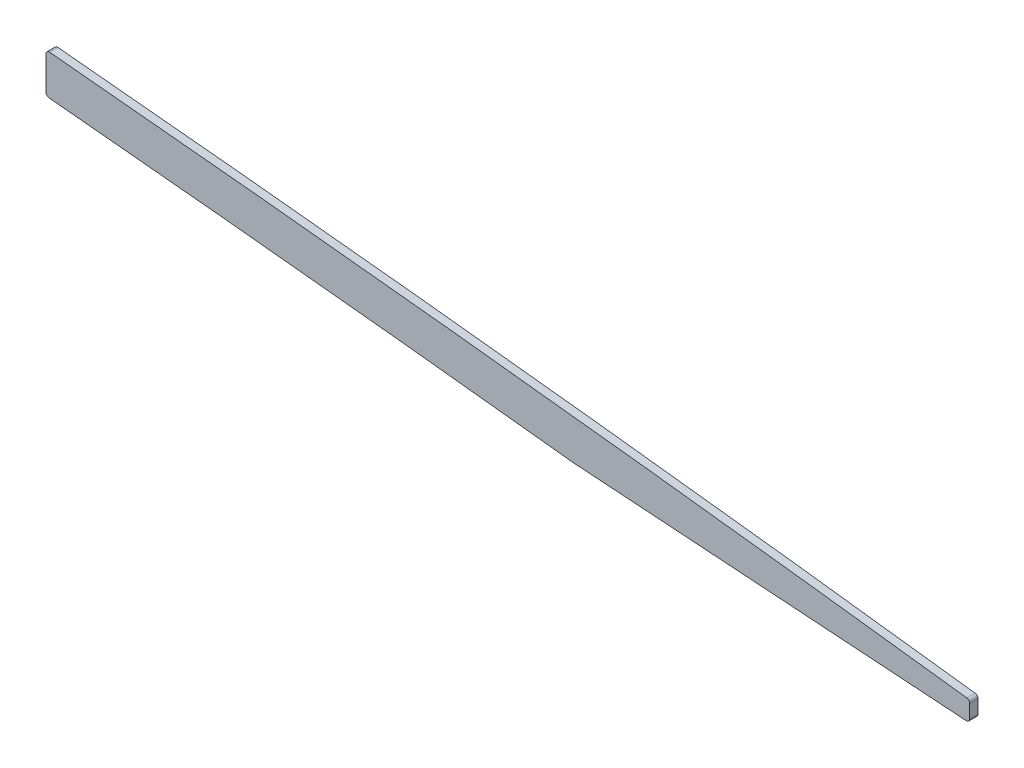
ISO-10303-21;
HEADER;
FILE_DESCRIPTION(('STEP AP214'),'2;1');
FILE_NAME('part.step','',(''),(''),'','','');
FILE_SCHEMA(('AUTOMOTIVE_DESIGN { 1 0 10303 214 1 1 1 1 }'));
ENDSEC;
DATA;
#1=APPLICATION_CONTEXT('core data for automotive mechanical design processes');
#2=APPLICATION_PROTOCOL_DEFINITION('international standard','automotive_design',2000,#1);
#3=PRODUCT_CONTEXT('',#1,'mechanical');
#4=PRODUCT('Part','Part','',(#3));
#5=PRODUCT_RELATED_PRODUCT_CATEGORY('part','',(#4));
#6=PRODUCT_DEFINITION_FORMATION('','',#4);
#7=PRODUCT_DEFINITION_CONTEXT('part definition',#1,'design');
#8=PRODUCT_DEFINITION('design','',#6,#7);
#9=PRODUCT_DEFINITION_SHAPE('','',#8);
#10=(LENGTH_UNIT() NAMED_UNIT(*) SI_UNIT(.MILLI.,.METRE.));
#11=(NAMED_UNIT(*) PLANE_ANGLE_UNIT() SI_UNIT($,.RADIAN.));
#12=(NAMED_UNIT(*) SI_UNIT($,.STERADIAN.) SOLID_ANGLE_UNIT());
#13=UNCERTAINTY_MEASURE_WITH_UNIT(LENGTH_MEASURE(1.E-05),#10,'distance_accuracy_value','');
#14=(GEOMETRIC_REPRESENTATION_CONTEXT(3) GLOBAL_UNCERTAINTY_ASSIGNED_CONTEXT((#13)) GLOBAL_UNIT_ASSIGNED_CONTEXT((#10,
#11,#12)) REPRESENTATION_CONTEXT('',''));
#15=CARTESIAN_POINT('',(0.,0.,0.));
#16=DIRECTION('',(0.,0.,1.));
#17=DIRECTION('',(1.,0.,0.));
#18=AXIS2_PLACEMENT_3D('',#15,#16,#17);
#19=CARTESIAN_POINT('',(2311.4,-7.40544774906732E-11,1.5875));
#20=DIRECTION('',(1.,0.,0.));
#21=DIRECTION('',(0.,1.,0.));
#22=AXIS2_PLACEMENT_3D('',#19,#20,#21);
#23=PLANE('',#22);
#24=DIRECTION('',(0.,-1.,0.));
#25=VECTOR('',#24,1.);
#26=CARTESIAN_POINT('',(2311.4,-7.40544774906732E-11,-1.5875));
#27=LINE('',#26,#25);
#28=CARTESIAN_POINT('',(2311.4,134.435488249285,-1.5875));
#29=VERTEX_POINT('',#28);
#30=CARTESIAN_POINT('',(2311.4,121.679854212148,-1.5875));
#31=VERTEX_POINT('',#30);
#32=EDGE_CURVE('E270',#29,#31,#27,.T.);
#33=ORIENTED_EDGE('',*,*,#32,.T.);
#34=DIRECTION('',(0.,0.,-1.));
#35=VECTOR('',#34,1.);
#36=CARTESIAN_POINT('',(2311.4,121.679854212148,1.5875));
#37=LINE('',#36,#35);
#38=CARTESIAN_POINT('',(2311.4,121.679854212148,1.5875));
#39=VERTEX_POINT('',#38);
#40=EDGE_CURVE('E226',#31,#39,#37,.F.);
#41=ORIENTED_EDGE('',*,*,#40,.T.);
#42=DIRECTION('',(0.,-1.,0.));
#43=VECTOR('',#42,1.);
#44=CARTESIAN_POINT('',(2311.4,-7.40544774906732E-11,1.5875));
#45=LINE('',#44,#43);
#46=CARTESIAN_POINT('',(2311.4,134.435488249285,1.5875));
#47=VERTEX_POINT('',#46);
#48=EDGE_CURVE('E147',#47,#39,#45,.T.);
#49=ORIENTED_EDGE('',*,*,#48,.F.);
#50=DIRECTION('',(0.,0.,1.));
#51=VECTOR('',#50,1.);
#52=CARTESIAN_POINT('',(2311.4,134.435488249285,-1.5875));
#53=LINE('',#52,#51);
#54=EDGE_CURVE('E299',#47,#29,#53,.F.);
#55=ORIENTED_EDGE('',*,*,#54,.T.);
#56=EDGE_LOOP('',(#33,#41,#49,#55));
#57=FACE_BOUND('',#56,.T.);
#58=ADVANCED_FACE('F47',(#57),#23,.F.);
#59=CARTESIAN_POINT('',(816.035490090418,249.602504502473,1.5875));
#60=CARTESIAN_POINT('',(820.895958915978,248.948752998504,1.5875));
#61=CARTESIAN_POINT('',(830.611237516535,247.699685180795,1.5875));
#62=CARTESIAN_POINT('',(845.281067269815,245.953419482549,1.5875));
#63=CARTESIAN_POINT('',(860.086531547021,244.295598067093,1.5875));
#64=CARTESIAN_POINT('',(879.83070343434,242.186646027517,1.5875));
#65=CARTESIAN_POINT('',(904.36996709185,239.698279805688,1.5875));
#66=CARTESIAN_POINT('',(933.571022669327,236.832150625483,1.5875));
#67=CARTESIAN_POINT('',(962.642718040815,234.023667740898,1.5875));
#68=CARTESIAN_POINT('',(991.762593942943,231.241975908087,1.5875));
#69=CARTESIAN_POINT('',(1021.07201031471,228.475862291185,1.5875));
#70=CARTESIAN_POINT('',(1060.37643731472,224.796956681051,1.5875));
#71=CARTESIAN_POINT('',(1109.51301557685,220.18437886172,1.5875));
#72=CARTESIAN_POINT('',(1168.51119036116,214.817071985159,1.5875));
#73=CARTESIAN_POINT('',(1227.50012979269,209.662054041939,1.5875));
#74=CARTESIAN_POINT('',(1306.13316794657,203.021178328389,1.5875));
#75=CARTESIAN_POINT('',(1404.36147710547,194.920725932278,1.5875));
#76=CARTESIAN_POINT('',(1522.23985107062,184.918066624094,1.5875));
#77=CARTESIAN_POINT('',(1640.18285649102,175.16700778633,1.5875));
#78=CARTESIAN_POINT('',(1758.16535256682,165.7576394845,1.5875));
#79=CARTESIAN_POINT('',(1876.15538476943,156.590937078959,1.5875));
#80=CARTESIAN_POINT('',(1994.08749188002,147.453250142139,1.5875));
#81=CARTESIAN_POINT('',(2092.26869206097,139.624216053351,1.5875));
#82=CARTESIAN_POINT('',(2170.74802904205,133.07965672904,1.5875));
#83=CARTESIAN_POINT('',(2219.77173097685,128.842227835716,1.5875));
#84=CARTESIAN_POINT('',(2258.98398824696,125.347211495477,1.5875));
#85=CARTESIAN_POINT('',(2288.37945753647,122.670854497073,1.5875));
#86=CARTESIAN_POINT('',(2317.81224311603,119.931729386451,1.5875));
#87=CARTESIAN_POINT('',(2347.55150917161,117.100365282643,1.5875));
#88=CARTESIAN_POINT('',(2377.15989972739,114.210118529692,1.5875));
#89=CARTESIAN_POINT('',(2406.46965385077,111.268968010355,1.5875));
#90=CARTESIAN_POINT('',(2435.81832605954,108.240091266207,1.5875));
#91=CARTESIAN_POINT('',(2469.02470752222,104.715289084564,1.5875));
#92=CARTESIAN_POINT('',(2497.31327256554,101.612328458115,1.5875));
#93=CARTESIAN_POINT('',(2518.24528997175,99.2591125176473,1.5875));
#94=CARTESIAN_POINT('',(2543.59485523623,96.3823723988054,1.5875));
#95=CARTESIAN_POINT('',(2583.46809293913,91.7389200548886,1.5875));
#96=CARTESIAN_POINT('',(2626.50474404992,86.507235465956,1.5875));
#97=CARTESIAN_POINT('',(2656.9573225255,82.7046844863666,1.5875));
#98=CARTESIAN_POINT('',(2676.22814845177,80.2695409508187,1.5875));
#99=CARTESIAN_POINT('',(2689.72957405404,78.5388507758172,1.5875));
#100=CARTESIAN_POINT('',(2697.83785996013,77.4903351724698,1.5875));
#101=B_SPLINE_CURVE_WITH_KNOTS('',3,(#59,#60,#61,#62,#63,#64,#65,#66,#67,#68,#69,#70,#71,#72,
#73,#74,#75,#76,#77,#78,#79,#80,#81,#82,#83,#84,#85,#86,#87,#88,#89,#90,#91,#92,#93,#94,#95,#96,
#97,#98,#99,#100),.UNSPECIFIED.,.F.,.F.,(4,1,1,1,1,1,1,1,1,1,1,1,1,1,1,1,1,1,1,1,1,1,1,1,1,1,1,
1,1,1,1,1,1,1,1,1,1,1,1,4),(77.9308215150932,79.3861761032565,80.8415306914199,82.2968852795832,
83.7522398677466,86.6629490440732,89.5736582203999,92.4843673967266,95.3950765730532,
98.3057857493799,101.216494925707,107.03791327836,112.859331631013,118.680749983667,
124.50216833632,136.145005041627,147.787841746933,159.43067845224,171.073515157547,
182.716351862853,194.35918856816,206.002025273467,211.82344362612,217.644861978773,
220.5555711551,223.466280331427,226.376989507753,229.28769868408,232.198407860407,
235.109117036733,238.01982621306,240.930535389387,244.99811874271,246.453473330873,
247.181150624955,252.573372094693,258.394790447347,260.132380463724,261.765911798234,
264.2162088),.UNSPECIFIED.);
#102=DIRECTION('',(0.,0.,-1.));
#103=VECTOR('',#102,1.);
#104=SURFACE_OF_LINEAR_EXTRUSION('',#101,#103);
#105=CARTESIAN_POINT('',(2312.55144834193,120.415399584901,1.5875));
#106=VERTEX_POINT('',#105);
#107=CARTESIAN_POINT('',(2513.37105245866,99.8062133455946,1.5875));
#108=VERTEX_POINT('',#107);
#109=EDGE_CURVE('E130',#106,#108,#101,.T.);
#110=ORIENTED_EDGE('',*,*,#109,.F.);
#111=DIRECTION('',(0.,0.,-1.));
#112=VECTOR('',#111,1.);
#113=CARTESIAN_POINT('',(2312.55144834193,120.415399584901,1.5875));
#114=LINE('',#113,#112);
#115=CARTESIAN_POINT('',(2312.55144834193,120.415399584901,-1.5875));
#116=VERTEX_POINT('',#115);
#117=EDGE_CURVE('E139',#106,#116,#114,.T.);
#118=ORIENTED_EDGE('',*,*,#117,.T.);
#119=CARTESIAN_POINT('',(816.035490090418,249.602504502473,-1.5875));
#120=CARTESIAN_POINT('',(820.895958915978,248.948752998504,-1.5875));
#121=CARTESIAN_POINT('',(830.611237516535,247.699685180795,-1.5875));
#122=CARTESIAN_POINT('',(845.281067269815,245.953419482549,-1.5875));
#123=CARTESIAN_POINT('',(860.086531547021,244.295598067093,-1.5875));
#124=CARTESIAN_POINT('',(879.83070343434,242.186646027517,-1.5875));
#125=CARTESIAN_POINT('',(904.36996709185,239.698279805688,-1.5875));
#126=CARTESIAN_POINT('',(933.571022669327,236.832150625483,-1.5875));
#127=CARTESIAN_POINT('',(962.642718040815,234.023667740898,-1.5875));
#128=CARTESIAN_POINT('',(991.762593942943,231.241975908087,-1.5875));
#129=CARTESIAN_POINT('',(1021.07201031471,228.475862291185,-1.5875));
#130=CARTESIAN_POINT('',(1060.37643731472,224.796956681051,-1.5875));
#131=CARTESIAN_POINT('',(1109.51301557685,220.18437886172,-1.5875));
#132=CARTESIAN_POINT('',(1168.51119036116,214.817071985159,-1.5875));
#133=CARTESIAN_POINT('',(1227.50012979269,209.662054041939,-1.5875));
#134=CARTESIAN_POINT('',(1306.13316794657,203.021178328389,-1.5875));
#135=CARTESIAN_POINT('',(1404.36147710547,194.920725932278,-1.5875));
#136=CARTESIAN_POINT('',(1522.23985107062,184.918066624094,-1.5875));
#137=CARTESIAN_POINT('',(1640.18285649102,175.16700778633,-1.5875));
#138=CARTESIAN_POINT('',(1758.16535256682,165.7576394845,-1.5875));
#139=CARTESIAN_POINT('',(1876.15538476943,156.590937078959,-1.5875));
#140=CARTESIAN_POINT('',(1994.08749188002,147.453250142139,-1.5875));
#141=CARTESIAN_POINT('',(2092.26869206097,139.624216053351,-1.5875));
#142=CARTESIAN_POINT('',(2170.74802904205,133.07965672904,-1.5875));
#143=CARTESIAN_POINT('',(2219.77173097685,128.842227835716,-1.5875));
#144=CARTESIAN_POINT('',(2258.98398824696,125.347211495477,-1.5875));
#145=CARTESIAN_POINT('',(2288.37945753647,122.670854497073,-1.5875));
#146=CARTESIAN_POINT('',(2317.81224311603,119.931729386451,-1.5875));
#147=CARTESIAN_POINT('',(2347.55150917161,117.100365282643,-1.5875));
#148=CARTESIAN_POINT('',(2377.15989972739,114.210118529692,-1.5875));
#149=CARTESIAN_POINT('',(2406.46965385077,111.268968010355,-1.5875));
#150=CARTESIAN_POINT('',(2435.81832605954,108.240091266207,-1.5875));
#151=CARTESIAN_POINT('',(2469.02470752222,104.715289084564,-1.5875));
#152=CARTESIAN_POINT('',(2497.31327256554,101.612328458115,-1.5875));
#153=CARTESIAN_POINT('',(2518.24528997175,99.2591125176473,-1.5875));
#154=CARTESIAN_POINT('',(2543.59485523623,96.3823723988054,-1.5875));
#155=CARTESIAN_POINT('',(2583.46809293913,91.7389200548886,-1.5875));
#156=CARTESIAN_POINT('',(2626.50474404992,86.507235465956,-1.5875));
#157=CARTESIAN_POINT('',(2656.9573225255,82.7046844863666,-1.5875));
#158=CARTESIAN_POINT('',(2676.22814845177,80.2695409508187,-1.5875));
#159=CARTESIAN_POINT('',(2689.72957405404,78.5388507758172,-1.5875));
#160=CARTESIAN_POINT('',(2697.83785996013,77.4903351724698,-1.5875));
#161=B_SPLINE_CURVE_WITH_KNOTS('',3,(#119,#120,#121,#122,#123,#124,#125,#126,#127,#128,#129,
#130,#131,#132,#133,#134,#135,#136,#137,#138,#139,#140,#141,#142,#143,#144,#145,#146,#147,#148,
#149,#150,#151,#152,#153,#154,#155,#156,#157,#158,#159,#160),.UNSPECIFIED.,.F.,.F.,(4,1,1,1,1,1,
1,1,1,1,1,1,1,1,1,1,1,1,1,1,1,1,1,1,1,1,1,1,1,1,1,1,1,1,1,1,1,1,1,4),(77.9308215150932,
79.3861761032565,80.8415306914199,82.2968852795832,83.7522398677466,86.6629490440732,
89.5736582203999,92.4843673967266,95.3950765730532,98.3057857493799,101.216494925707,
107.03791327836,112.859331631013,118.680749983667,124.50216833632,136.145005041627,
147.787841746933,159.43067845224,171.073515157547,182.716351862853,194.35918856816,
206.002025273467,211.82344362612,217.644861978773,220.5555711551,223.466280331427,
226.376989507753,229.28769868408,232.198407860407,235.109117036733,238.01982621306,
240.930535389387,244.99811874271,246.453473330873,247.181150624955,252.573372094693,
258.394790447347,260.132380463724,261.765911798234,264.2162088),.UNSPECIFIED.);
#162=CARTESIAN_POINT('',(2513.37105245866,99.8062133455946,-1.5875));
#163=VERTEX_POINT('',#162);
#164=EDGE_CURVE('E137',#116,#163,#161,.T.);
#165=ORIENTED_EDGE('',*,*,#164,.T.);
#166=DIRECTION('',(0.,0.,-1.));
#167=VECTOR('',#166,1.);
#168=CARTESIAN_POINT('',(2513.37105245866,99.8062133455946,1.5875));
#169=LINE('',#168,#167);
#170=EDGE_CURVE('E124',#108,#163,#169,.T.);
#171=ORIENTED_EDGE('',*,*,#170,.F.);
#172=EDGE_LOOP('',(#110,#118,#165,#171));
#173=FACE_BOUND('',#172,.T.);
#174=ADVANCED_FACE('F134',(#173),#104,.F.);
#175=CARTESIAN_POINT('',(18.6387186444081,271.237546195136,1.5875));
#176=DIRECTION('',(-0.0685556534196936,-0.997647293578346,0.));
#177=DIRECTION('',(0.997647293578346,-0.0685556534196936,0.));
#178=AXIS2_PLACEMENT_3D('',#175,#176,#177);
#179=PLANE('',#178);
#180=DIRECTION('',(-0.997647293578346,0.0685556534196936,0.));
#181=VECTOR('',#180,1.);
#182=CARTESIAN_POINT('',(18.6387186444081,271.237546195136,-1.5875));
#183=LINE('',#182,#181);
#184=CARTESIAN_POINT('',(2664.05543432016,89.451585687953,-1.5875));
#185=VERTEX_POINT('',#184);
#186=EDGE_CURVE('E277',#185,#163,#183,.T.);
#187=ORIENTED_EDGE('',*,*,#186,.F.);
#188=DIRECTION('',(0.,0.,-1.));
#189=VECTOR('',#188,1.);
#190=CARTESIAN_POINT('',(2664.05543432016,89.4515856879531,1.5875));
#191=LINE('',#190,#189);
#192=CARTESIAN_POINT('',(2664.05543432016,89.451585687953,1.5875));
#193=VERTEX_POINT('',#192);
#194=EDGE_CURVE('E11',#185,#193,#191,.F.);
#195=ORIENTED_EDGE('',*,*,#194,.T.);
#196=DIRECTION('',(-0.997647293578346,0.0685556534196936,0.));
#197=VECTOR('',#196,1.);
#198=CARTESIAN_POINT('',(18.6387186444081,271.237546195136,1.5875));
#199=LINE('',#198,#197);
#200=EDGE_CURVE('E120',#193,#108,#199,.T.);
#201=ORIENTED_EDGE('',*,*,#200,.T.);
#202=ORIENTED_EDGE('',*,*,#170,.T.);
#203=EDGE_LOOP('',(#187,#195,#201,#202));
#204=FACE_BOUND('',#203,.T.);
#205=ADVANCED_FACE('F123',(#204),#179,.T.);
#206=CARTESIAN_POINT('',(2665.41250000001,1.54114769880156E-10,1.5875));
#207=DIRECTION('',(1.,0.,0.));
#208=DIRECTION('',(0.,1.,0.));
#209=AXIS2_PLACEMENT_3D('',#206,#207,#208);
#210=PLANE('',#209);
#211=DIRECTION('',(0.,-1.,0.));
#212=VECTOR('',#211,1.);
#213=CARTESIAN_POINT('',(2665.41250000001,1.54114769880156E-10,-1.5875));
#214=LINE('',#213,#212);
#215=CARTESIAN_POINT('',(2665.4125,95.8764407852826,-1.5875));
#216=VERTEX_POINT('',#215);
#217=CARTESIAN_POINT('',(2665.4125,90.7185977507976,-1.5875));
#218=VERTEX_POINT('',#217);
#219=EDGE_CURVE('E199',#216,#218,#214,.T.);
#220=ORIENTED_EDGE('',*,*,#219,.F.);
#221=DIRECTION('',(0.,0.,-1.));
#222=VECTOR('',#221,1.);
#223=CARTESIAN_POINT('',(2665.4125,95.8764407852826,1.5875));
#224=LINE('',#223,#222);
#225=CARTESIAN_POINT('',(2665.4125,95.8764407852826,1.5875));
#226=VERTEX_POINT('',#225);
#227=EDGE_CURVE('E56',#216,#226,#224,.F.);
#228=ORIENTED_EDGE('',*,*,#227,.T.);
#229=DIRECTION('',(0.,-1.,0.));
#230=VECTOR('',#229,1.);
#231=CARTESIAN_POINT('',(2665.41250000001,1.54114769880156E-10,1.5875));
#232=LINE('',#231,#230);
#233=CARTESIAN_POINT('',(2665.4125,90.7185977507976,1.5875));
#234=VERTEX_POINT('',#233);
#235=EDGE_CURVE('E129',#226,#234,#232,.T.);
#236=ORIENTED_EDGE('',*,*,#235,.T.);
#237=DIRECTION('',(0.,0.,-1.));
#238=VECTOR('',#237,1.);
#239=CARTESIAN_POINT('',(2665.4125,90.7185977507976,1.5875));
#240=LINE('',#239,#238);
#241=EDGE_CURVE('E201',#234,#218,#240,.T.);
#242=ORIENTED_EDGE('',*,*,#241,.T.);
#243=EDGE_LOOP('',(#220,#228,#236,#242));
#244=FACE_BOUND('',#243,.T.);
#245=ADVANCED_FACE('F197',(#244),#210,.T.);
#246=CARTESIAN_POINT('',(818.067033698442,264.706491743222,1.5875));
#247=CARTESIAN_POINT('',(827.043059883077,263.499182154688,1.5875));
#248=CARTESIAN_POINT('',(836.029088262746,262.37336018535,1.5875));
#249=CARTESIAN_POINT('',(845.086758911477,261.305822737124,1.5875));
#250=CARTESIAN_POINT('',(891.386485356828,256.087047064925,1.5875));
#251=CARTESIAN_POINT('',(937.686211733138,251.779150949417,1.5875));
#252=CARTESIAN_POINT('',(973.452075064018,248.227669424888,1.5875));
#253=CARTESIAN_POINT('',(1071.94667214103,239.051054037575,1.5875));
#254=CARTESIAN_POINT('',(1170.4412693194,229.731506737662,1.5875));
#255=CARTESIAN_POINT('',(1231.79194034372,224.503945812963,1.5875));
#256=CARTESIAN_POINT('',(1324.89933614602,216.790627817024,1.5875));
#257=CARTESIAN_POINT('',(1418.00673093479,209.040117977579,1.5875));
#258=CARTESIAN_POINT('',(1449.7429359212,206.361809936344,1.5875));
#259=CARTESIAN_POINT('',(1636.92860677809,190.521130341518,1.5875));
#260=CARTESIAN_POINT('',(1824.11427763497,175.409157235081,1.5875));
#261=CARTESIAN_POINT('',(1979.96694737597,164.299650252625,1.5875));
#262=CARTESIAN_POINT('',(2156.26863942885,150.414433314205,1.5875));
#263=CARTESIAN_POINT('',(2332.5703304682,133.85721640186,1.5875));
#264=CARTESIAN_POINT('',(2354.21298315715,131.785082220072,1.5875));
#265=CARTESIAN_POINT('',(2436.3555443117,123.723952135345,1.5875));
#266=CARTESIAN_POINT('',(2518.49810546626,114.859112916573,1.5875));
#267=CARTESIAN_POINT('',(2579.48130742255,107.74251493933,1.5875));
#268=CARTESIAN_POINT('',(2639.63682069028,100.383443901382,1.5875));
#269=CARTESIAN_POINT('',(2699.79233294449,92.6044886503654,1.5875));
#270=(BOUNDED_CURVE() B_SPLINE_CURVE(5,(#246,#247,#248,#249,#250,#251,#252,#253,#254,#255,#256,
#257,#258,#259,#260,#261,#262,#263,#264,#265,#266,#267,#268,#269),.UNSPECIFIED.,.F.,
.F.) B_SPLINE_CURVE_WITH_KNOTS((6,3,3,3,3,3,3,6),(77.9308215150932,82.46579272,100.7932901,
131.0989539,146.7691983,223.5339586,233.9431167,264.2162088),
.UNSPECIFIED.) CURVE() GEOMETRIC_REPRESENTATION_ITEM() RATIONAL_B_SPLINE_CURVE((1.,1.,1.,1.,1.,
1.,1.,1.,1.,1.,1.,1.,1.,1.,1.,1.,1.,1.,1.,1.,1.,1.,1.,1.)) REPRESENTATION_ITEM(''));
#271=DIRECTION('',(0.,0.,-1.));
#272=VECTOR('',#271,1.);
#273=SURFACE_OF_LINEAR_EXTRUSION('',#270,#272);
#274=CARTESIAN_POINT('',(2664.30138258873,97.1364631354804,-1.5875));
#275=CARTESIAN_POINT('',(2611.18909164487,103.833660432831,-1.5875));
#276=CARTESIAN_POINT('',(2557.89544916821,110.239289178493,-1.5875));
#277=CARTESIAN_POINT('',(2504.07783710443,116.409158480157,-1.5875));
#278=CARTESIAN_POINT('',(2433.59454121578,123.955194832583,-1.5875));
#279=CARTESIAN_POINT('',(2363.11124532712,130.909485863991,-1.5875));
#280=CARTESIAN_POINT('',(2346.23667710793,132.541975503277,-1.5875));
#281=CARTESIAN_POINT('',(2329.46067334562,134.138263582643,-1.5875));
#282=CARTESIAN_POINT('',(2312.78844254862,135.699953101574,-1.5875));
#283=(BOUNDED_CURVE() B_SPLINE_CURVE(5,(#274,#275,#276,#277,#278,#279,#280,#281,#282),
.UNSPECIFIED.,.F.,.F.) B_SPLINE_CURVE_WITH_KNOTS((6,3,6),(225.737452883937,252.439625370516,
260.645289186579),
.UNSPECIFIED.) CURVE() GEOMETRIC_REPRESENTATION_ITEM() RATIONAL_B_SPLINE_CURVE((1.,1.,1.,1.,1.,
1.,1.,1.,1.)) REPRESENTATION_ITEM(''));
#284=CARTESIAN_POINT('',(2312.78844256647,135.699953292056,-1.5875));
#285=VERTEX_POINT('',#284);
#286=CARTESIAN_POINT('',(2664.30138268303,97.1364638833327,-1.5875));
#287=VERTEX_POINT('',#286);
#288=EDGE_CURVE('E151',#285,#287,#283,.F.);
#289=ORIENTED_EDGE('',*,*,#288,.F.);
#290=DIRECTION('',(0.,0.,-1.));
#291=VECTOR('',#290,1.);
#292=CARTESIAN_POINT('',(2312.78844254863,135.699953101574,-1.5875));
#293=LINE('',#292,#291);
#294=CARTESIAN_POINT('',(2312.78844256657,135.699953293182,1.5875));
#295=VERTEX_POINT('',#294);
#296=EDGE_CURVE('E204',#285,#295,#293,.F.);
#297=ORIENTED_EDGE('',*,*,#296,.T.);
#298=CARTESIAN_POINT('',(2312.78844254863,135.699953101574,1.5875));
#299=CARTESIAN_POINT('',(2329.46067334562,134.138263582643,1.5875));
#300=CARTESIAN_POINT('',(2346.23667710793,132.541975503277,1.5875));
#301=CARTESIAN_POINT('',(2363.11124532712,130.909485863991,1.5875));
#302=CARTESIAN_POINT('',(2433.59454121578,123.955194832583,1.5875));
#303=CARTESIAN_POINT('',(2504.07783710443,116.409158480157,1.5875));
#304=CARTESIAN_POINT('',(2557.89544916821,110.239289178493,1.5875));
#305=CARTESIAN_POINT('',(2611.18909164487,103.833660432831,1.5875));
#306=CARTESIAN_POINT('',(2664.30138258873,97.1364631354806,1.5875));
#307=(BOUNDED_CURVE() B_SPLINE_CURVE(5,(#298,#299,#300,#301,#302,#303,#304,#305,#306),
.UNSPECIFIED.,.F.,.F.) B_SPLINE_CURVE_WITH_KNOTS((6,3,6),(225.737452883937,233.9431167,
260.645289186579),
.UNSPECIFIED.) CURVE() GEOMETRIC_REPRESENTATION_ITEM() RATIONAL_B_SPLINE_CURVE((1.,1.,1.,1.,1.,
1.,1.,1.,1.)) REPRESENTATION_ITEM(''));
#308=CARTESIAN_POINT('',(2664.30138268297,97.1364638828841,1.5875));
#309=VERTEX_POINT('',#308);
#310=EDGE_CURVE('E140',#295,#309,#307,.T.);
#311=ORIENTED_EDGE('',*,*,#310,.T.);
#312=DIRECTION('',(0.,0.,-1.));
#313=VECTOR('',#312,1.);
#314=CARTESIAN_POINT('',(2664.30138258872,97.1364631354811,1.5875));
#315=LINE('',#314,#313);
#316=EDGE_CURVE('E186',#309,#287,#315,.T.);
#317=ORIENTED_EDGE('',*,*,#316,.T.);
#318=EDGE_LOOP('',(#289,#297,#311,#317));
#319=FACE_BOUND('',#318,.T.);
#320=ADVANCED_FACE('F247',(#319),#273,.T.);
#321=CARTESIAN_POINT('',(0.,0.,1.5875));
#322=DIRECTION('',(0.,0.,1.));
#323=DIRECTION('',(1.,0.,0.));
#324=AXIS2_PLACEMENT_3D('',#321,#322,#323);
#325=PLANE('',#324);
#326=ORIENTED_EDGE('',*,*,#48,.T.);
#327=CARTESIAN_POINT('',(2312.67,121.679854212148,1.5875));
#328=DIRECTION('',(0.,0.,1.));
#329=DIRECTION('',(1.,0.,0.));
#330=AXIS2_PLACEMENT_3D('',#327,#328,#329);
#331=CIRCLE('',#330,1.27);
#332=EDGE_CURVE('E144',#39,#106,#331,.T.);
#333=ORIENTED_EDGE('',*,*,#332,.T.);
#334=ORIENTED_EDGE('',*,*,#109,.T.);
#335=ORIENTED_EDGE('',*,*,#200,.F.);
#336=CARTESIAN_POINT('',(2664.1425,90.7185977507976,1.5875));
#337=DIRECTION('',(0.,0.,1.));
#338=DIRECTION('',(1.,0.,0.));
#339=AXIS2_PLACEMENT_3D('',#336,#337,#338);
#340=CIRCLE('',#339,1.27);
#341=EDGE_CURVE('E189',#193,#234,#340,.T.);
#342=ORIENTED_EDGE('',*,*,#341,.T.);
#343=ORIENTED_EDGE('',*,*,#235,.F.);
#344=CARTESIAN_POINT('',(2664.1425,95.8764407852825,1.5875));
#345=DIRECTION('',(0.,0.,1.));
#346=DIRECTION('',(1.,0.,0.));
#347=AXIS2_PLACEMENT_3D('',#344,#345,#346);
#348=CIRCLE('',#347,1.27);
#349=EDGE_CURVE('E63',#226,#309,#348,.T.);
#350=ORIENTED_EDGE('',*,*,#349,.T.);
#351=ORIENTED_EDGE('',*,*,#310,.F.);
#352=CARTESIAN_POINT('',(2312.67,134.435488249285,1.5875));
#353=DIRECTION('',(0.,0.,1.));
#354=DIRECTION('',(1.,0.,0.));
#355=AXIS2_PLACEMENT_3D('',#352,#353,#354);
#356=CIRCLE('',#355,1.27);
#357=EDGE_CURVE('E71',#295,#47,#356,.T.);
#358=ORIENTED_EDGE('',*,*,#357,.T.);
#359=EDGE_LOOP('',(#326,#333,#334,#335,#342,#343,#350,#351,#358));
#360=FACE_BOUND('',#359,.T.);
#361=ADVANCED_FACE('F143',(#360),#325,.T.);
#362=CARTESIAN_POINT('',(0.,0.,-1.5875));
#363=DIRECTION('',(0.,0.,1.));
#364=DIRECTION('',(1.,0.,0.));
#365=AXIS2_PLACEMENT_3D('',#362,#363,#364);
#366=PLANE('',#365);
#367=ORIENTED_EDGE('',*,*,#164,.F.);
#368=CARTESIAN_POINT('',(2312.67,121.679854212148,-1.5875));
#369=DIRECTION('',(0.,0.,1.));
#370=DIRECTION('',(1.,0.,0.));
#371=AXIS2_PLACEMENT_3D('',#368,#369,#370);
#372=CIRCLE('',#371,1.27);
#373=EDGE_CURVE('E291',#116,#31,#372,.F.);
#374=ORIENTED_EDGE('',*,*,#373,.T.);
#375=ORIENTED_EDGE('',*,*,#32,.F.);
#376=CARTESIAN_POINT('',(2312.67,134.435488249285,-1.5875));
#377=DIRECTION('',(0.,0.,1.));
#378=DIRECTION('',(1.,0.,0.));
#379=AXIS2_PLACEMENT_3D('',#376,#377,#378);
#380=CIRCLE('',#379,1.27);
#381=EDGE_CURVE('E288',#29,#285,#380,.F.);
#382=ORIENTED_EDGE('',*,*,#381,.T.);
#383=ORIENTED_EDGE('',*,*,#288,.T.);
#384=CARTESIAN_POINT('',(2664.1425,95.8764407852825,-1.5875));
#385=DIRECTION('',(0.,0.,1.));
#386=DIRECTION('',(1.,0.,0.));
#387=AXIS2_PLACEMENT_3D('',#384,#385,#386);
#388=CIRCLE('',#387,1.27);
#389=EDGE_CURVE('E285',#287,#216,#388,.F.);
#390=ORIENTED_EDGE('',*,*,#389,.T.);
#391=ORIENTED_EDGE('',*,*,#219,.T.);
#392=CARTESIAN_POINT('',(2664.1425,90.7185977507976,-1.5875));
#393=DIRECTION('',(0.,0.,1.));
#394=DIRECTION('',(1.,0.,0.));
#395=AXIS2_PLACEMENT_3D('',#392,#393,#394);
#396=CIRCLE('',#395,1.27);
#397=EDGE_CURVE('E278',#218,#185,#396,.F.);
#398=ORIENTED_EDGE('',*,*,#397,.T.);
#399=ORIENTED_EDGE('',*,*,#186,.T.);
#400=EDGE_LOOP('',(#367,#374,#375,#382,#383,#390,#391,#398,#399));
#401=FACE_BOUND('',#400,.T.);
#402=ADVANCED_FACE('F172',(#401),#366,.F.);
#403=CARTESIAN_POINT('',(2312.67,121.679854212148,0.));
#404=DIRECTION('',(0.,0.,-1.));
#405=DIRECTION('',(-1.,0.,0.));
#406=AXIS2_PLACEMENT_3D('',#403,#404,#405);
#407=CYLINDRICAL_SURFACE('',#406,1.27);
#408=ORIENTED_EDGE('',*,*,#332,.F.);
#409=ORIENTED_EDGE('',*,*,#40,.F.);
#410=ORIENTED_EDGE('',*,*,#373,.F.);
#411=ORIENTED_EDGE('',*,*,#117,.F.);
#412=EDGE_LOOP('',(#408,#409,#410,#411));
#413=FACE_BOUND('',#412,.T.);
#414=ADVANCED_FACE('F168',(#413),#407,.T.);
#415=CARTESIAN_POINT('',(2312.67,134.435488249285,0.));
#416=DIRECTION('',(0.,0.,-1.));
#417=DIRECTION('',(-1.,0.,0.));
#418=AXIS2_PLACEMENT_3D('',#415,#416,#417);
#419=CYLINDRICAL_SURFACE('',#418,1.27);
#420=ORIENTED_EDGE('',*,*,#357,.F.);
#421=ORIENTED_EDGE('',*,*,#296,.F.);
#422=ORIENTED_EDGE('',*,*,#381,.F.);
#423=ORIENTED_EDGE('',*,*,#54,.F.);
#424=EDGE_LOOP('',(#420,#421,#422,#423));
#425=FACE_BOUND('',#424,.T.);
#426=ADVANCED_FACE('F171',(#425),#419,.T.);
#427=CARTESIAN_POINT('',(2664.1425,95.8764407852825,0.));
#428=DIRECTION('',(0.,0.,-1.));
#429=DIRECTION('',(-1.,0.,0.));
#430=AXIS2_PLACEMENT_3D('',#427,#428,#429);
#431=CYLINDRICAL_SURFACE('',#430,1.27);
#432=ORIENTED_EDGE('',*,*,#349,.F.);
#433=ORIENTED_EDGE('',*,*,#227,.F.);
#434=ORIENTED_EDGE('',*,*,#389,.F.);
#435=ORIENTED_EDGE('',*,*,#316,.F.);
#436=EDGE_LOOP('',(#432,#433,#434,#435));
#437=FACE_BOUND('',#436,.T.);
#438=ADVANCED_FACE('F175',(#437),#431,.T.);
#439=CARTESIAN_POINT('',(2664.1425,90.7185977507976,1.5875));
#440=DIRECTION('',(0.,0.,-1.));
#441=DIRECTION('',(-1.,0.,0.));
#442=AXIS2_PLACEMENT_3D('',#439,#440,#441);
#443=CYLINDRICAL_SURFACE('',#442,1.27);
#444=ORIENTED_EDGE('',*,*,#341,.F.);
#445=ORIENTED_EDGE('',*,*,#194,.F.);
#446=ORIENTED_EDGE('',*,*,#397,.F.);
#447=ORIENTED_EDGE('',*,*,#241,.F.);
#448=EDGE_LOOP('',(#444,#445,#446,#447));
#449=FACE_BOUND('',#448,.T.);
#450=ADVANCED_FACE('F49',(#449),#443,.T.);
#451=CLOSED_SHELL('',(#58,#174,#205,#245,#320,#361,#402,#414,#426,#438,#450));
#452=MANIFOLD_SOLID_BREP('B2',#451);
#453=ADVANCED_BREP_SHAPE_REPRESENTATION('',(#18,#452),#14);
#454=SHAPE_DEFINITION_REPRESENTATION(#9,#453);
ENDSEC;
END-ISO-10303-21;
